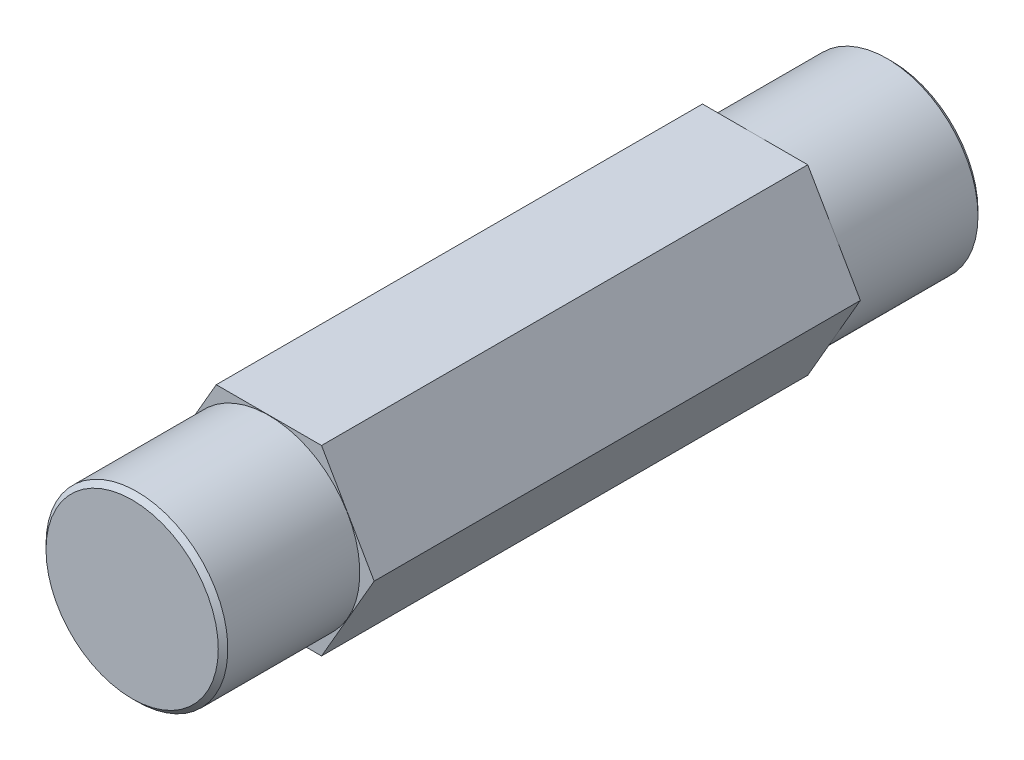
ISO-10303-21;
HEADER;
FILE_DESCRIPTION(('STEP AP214'),'2;1');
FILE_NAME('part.step','',(''),(''),'','','');
FILE_SCHEMA(('AUTOMOTIVE_DESIGN { 1 0 10303 214 1 1 1 1 }'));
ENDSEC;
DATA;
#1=APPLICATION_CONTEXT('core data for automotive mechanical design processes');
#2=APPLICATION_PROTOCOL_DEFINITION('international standard','automotive_design',2000,#1);
#3=PRODUCT_CONTEXT('',#1,'mechanical');
#4=PRODUCT('Part','Part','',(#3));
#5=PRODUCT_RELATED_PRODUCT_CATEGORY('part','',(#4));
#6=PRODUCT_DEFINITION_FORMATION('','',#4);
#7=PRODUCT_DEFINITION_CONTEXT('part definition',#1,'design');
#8=PRODUCT_DEFINITION('design','',#6,#7);
#9=PRODUCT_DEFINITION_SHAPE('','',#8);
#10=(LENGTH_UNIT() NAMED_UNIT(*) SI_UNIT(.MILLI.,.METRE.));
#11=(NAMED_UNIT(*) PLANE_ANGLE_UNIT() SI_UNIT($,.RADIAN.));
#12=(NAMED_UNIT(*) SI_UNIT($,.STERADIAN.) SOLID_ANGLE_UNIT());
#13=UNCERTAINTY_MEASURE_WITH_UNIT(LENGTH_MEASURE(1.E-05),#10,'distance_accuracy_value','');
#14=(GEOMETRIC_REPRESENTATION_CONTEXT(3) GLOBAL_UNCERTAINTY_ASSIGNED_CONTEXT((#13)) GLOBAL_UNIT_ASSIGNED_CONTEXT((#10,
#11,#12)) REPRESENTATION_CONTEXT('',''));
#15=CARTESIAN_POINT('',(0.,0.,0.));
#16=DIRECTION('',(0.,0.,1.));
#17=DIRECTION('',(1.,0.,0.));
#18=AXIS2_PLACEMENT_3D('',#15,#16,#17);
#19=CARTESIAN_POINT('',(0.,0.,19.84375));
#20=DIRECTION('',(0.,0.,1.));
#21=DIRECTION('',(1.,0.,0.));
#22=AXIS2_PLACEMENT_3D('',#19,#20,#21);
#23=PLANE('',#22);
#24=CARTESIAN_POINT('',(0.,0.,19.8437500000637));
#25=DIRECTION('',(0.,0.,-1.));
#26=DIRECTION('',(-1.,0.,0.));
#27=AXIS2_PLACEMENT_3D('',#24,#25,#26);
#28=CIRCLE('',#27,4.49980000001915);
#29=CARTESIAN_POINT('',(-4.49980000001915,0.,19.8437500000637));
#30=VERTEX_POINT('',#29);
#31=EDGE_CURVE('E19',#30,#30,#28,.T.);
#32=ORIENTED_EDGE('',*,*,#31,.F.);
#33=EDGE_LOOP('',(#32));
#34=FACE_BOUND('',#33,.T.);
#35=ADVANCED_FACE('F16',(#34),#23,.T.);
#36=CARTESIAN_POINT('',(0.,0.,-19.84375));
#37=DIRECTION('',(0.,0.,-1.));
#38=DIRECTION('',(-1.,0.,0.));
#39=AXIS2_PLACEMENT_3D('',#36,#37,#38);
#40=PLANE('',#39);
#41=CARTESIAN_POINT('',(0.,0.,-19.8437500000637));
#42=DIRECTION('',(0.,0.,1.));
#43=DIRECTION('',(1.,0.,0.));
#44=AXIS2_PLACEMENT_3D('',#41,#42,#43);
#45=CIRCLE('',#44,4.49980000001915);
#46=CARTESIAN_POINT('',(4.49980000001915,0.,-19.8437500000637));
#47=VERTEX_POINT('',#46);
#48=EDGE_CURVE('E104',#47,#47,#45,.T.);
#49=ORIENTED_EDGE('',*,*,#48,.F.);
#50=EDGE_LOOP('',(#49));
#51=FACE_BOUND('',#50,.T.);
#52=ADVANCED_FACE('F120',(#51),#40,.T.);
#53=CARTESIAN_POINT('',(0.,0.,19.5937500000696));
#54=DIRECTION('',(0.,0.,-1.));
#55=DIRECTION('',(-1.,0.,0.));
#56=AXIS2_PLACEMENT_3D('',#53,#54,#55);
#57=CONICAL_SURFACE('',#56,4.74980000001324,0.785398163397448);
#58=CARTESIAN_POINT('',(0.,0.,19.59375));
#59=DIRECTION('',(0.,0.,-1.));
#60=DIRECTION('',(-1.,0.,0.));
#61=AXIS2_PLACEMENT_3D('',#58,#59,#60);
#62=CIRCLE('',#61,4.7498);
#63=CARTESIAN_POINT('',(-4.7498,0.,19.59375));
#64=VERTEX_POINT('',#63);
#65=EDGE_CURVE('E101',#64,#64,#62,.T.);
#66=ORIENTED_EDGE('',*,*,#65,.F.);
#67=EDGE_LOOP('',(#66));
#68=FACE_BOUND('',#67,.T.);
#69=ORIENTED_EDGE('',*,*,#31,.T.);
#70=EDGE_LOOP('',(#69));
#71=FACE_BOUND('',#70,.T.);
#72=ADVANCED_FACE('F117',(#68,#71),#57,.T.);
#73=CARTESIAN_POINT('',(0.,0.,-19.5937500000696));
#74=DIRECTION('',(0.,0.,1.));
#75=DIRECTION('',(1.,0.,0.));
#76=AXIS2_PLACEMENT_3D('',#73,#74,#75);
#77=CONICAL_SURFACE('',#76,4.74980000001324,0.785398163397448);
#78=CARTESIAN_POINT('',(0.,0.,-19.59375));
#79=DIRECTION('',(0.,0.,1.));
#80=DIRECTION('',(1.,0.,0.));
#81=AXIS2_PLACEMENT_3D('',#78,#79,#80);
#82=CIRCLE('',#81,4.7498);
#83=CARTESIAN_POINT('',(4.7498,0.,-19.59375));
#84=VERTEX_POINT('',#83);
#85=EDGE_CURVE('E86',#84,#84,#82,.T.);
#86=ORIENTED_EDGE('',*,*,#85,.F.);
#87=EDGE_LOOP('',(#86));
#88=FACE_BOUND('',#87,.T.);
#89=ORIENTED_EDGE('',*,*,#48,.T.);
#90=EDGE_LOOP('',(#89));
#91=FACE_BOUND('',#90,.T.);
#92=ADVANCED_FACE('F163',(#88,#91),#77,.T.);
#93=CARTESIAN_POINT('',(0.,0.,19.84375));
#94=DIRECTION('',(0.,0.,-1.));
#95=DIRECTION('',(-1.,0.,0.));
#96=AXIS2_PLACEMENT_3D('',#93,#94,#95);
#97=CYLINDRICAL_SURFACE('',#96,4.7498);
#98=CARTESIAN_POINT('',(0.,0.,12.7));
#99=DIRECTION('',(0.,0.,-1.));
#100=DIRECTION('',(-1.,0.,0.));
#101=AXIS2_PLACEMENT_3D('',#98,#99,#100);
#102=CIRCLE('',#101,4.7498);
#103=CARTESIAN_POINT('',(-4.7498,0.,12.7));
#104=VERTEX_POINT('',#103);
#105=EDGE_CURVE('E109',#104,#104,#102,.T.);
#106=ORIENTED_EDGE('',*,*,#105,.F.);
#107=EDGE_LOOP('',(#106));
#108=FACE_BOUND('',#107,.T.);
#109=ORIENTED_EDGE('',*,*,#65,.T.);
#110=EDGE_LOOP('',(#109));
#111=FACE_BOUND('',#110,.T.);
#112=ADVANCED_FACE('F159',(#108,#111),#97,.T.);
#113=CARTESIAN_POINT('',(0.,0.,-19.84375));
#114=DIRECTION('',(0.,0.,1.));
#115=DIRECTION('',(1.,0.,0.));
#116=AXIS2_PLACEMENT_3D('',#113,#114,#115);
#117=CYLINDRICAL_SURFACE('',#116,4.7498);
#118=CARTESIAN_POINT('',(0.,0.,-12.7));
#119=DIRECTION('',(0.,0.,1.));
#120=DIRECTION('',(1.,0.,0.));
#121=AXIS2_PLACEMENT_3D('',#118,#119,#120);
#122=CIRCLE('',#121,4.7498);
#123=CARTESIAN_POINT('',(4.7498,0.,-12.7));
#124=VERTEX_POINT('',#123);
#125=EDGE_CURVE('E105',#124,#124,#122,.F.);
#126=ORIENTED_EDGE('',*,*,#125,.T.);
#127=EDGE_LOOP('',(#126));
#128=FACE_BOUND('',#127,.T.);
#129=ORIENTED_EDGE('',*,*,#85,.T.);
#130=EDGE_LOOP('',(#129));
#131=FACE_BOUND('',#130,.T.);
#132=ADVANCED_FACE('F156',(#128,#131),#117,.T.);
#133=CARTESIAN_POINT('',(2.74963065701559,4.76250000000001,12.7));
#134=DIRECTION('',(0.,-1.,0.));
#135=DIRECTION('',(1.,0.,0.));
#136=AXIS2_PLACEMENT_3D('',#133,#134,#135);
#137=PLANE('',#136);
#138=DIRECTION('',(0.,0.,1.));
#139=VECTOR('',#138,1.);
#140=CARTESIAN_POINT('',(-2.74963065701557,4.7625,12.7));
#141=LINE('',#140,#139);
#142=CARTESIAN_POINT('',(-2.74963065701557,4.7625,-12.7));
#143=VERTEX_POINT('',#142);
#144=CARTESIAN_POINT('',(-2.74963065701557,4.7625,12.7));
#145=VERTEX_POINT('',#144);
#146=EDGE_CURVE('E79',#143,#145,#141,.T.);
#147=ORIENTED_EDGE('',*,*,#146,.T.);
#148=DIRECTION('',(1.,0.,0.));
#149=VECTOR('',#148,1.);
#150=CARTESIAN_POINT('',(0.,4.76250000000001,12.7));
#151=LINE('',#150,#149);
#152=CARTESIAN_POINT('',(2.74963065701559,4.76250000000001,12.7));
#153=VERTEX_POINT('',#152);
#154=EDGE_CURVE('E69',#153,#145,#151,.F.);
#155=ORIENTED_EDGE('',*,*,#154,.F.);
#156=DIRECTION('',(0.,0.,1.));
#157=VECTOR('',#156,1.);
#158=CARTESIAN_POINT('',(2.74963065701559,4.76250000000001,12.7));
#159=LINE('',#158,#157);
#160=CARTESIAN_POINT('',(2.74963065701559,4.76250000000001,-12.7));
#161=VERTEX_POINT('',#160);
#162=EDGE_CURVE('E108',#153,#161,#159,.F.);
#163=ORIENTED_EDGE('',*,*,#162,.T.);
#164=DIRECTION('',(1.,0.,0.));
#165=VECTOR('',#164,1.);
#166=CARTESIAN_POINT('',(0.,4.76250000000001,-12.7));
#167=LINE('',#166,#165);
#168=EDGE_CURVE('E81',#161,#143,#167,.F.);
#169=ORIENTED_EDGE('',*,*,#168,.T.);
#170=EDGE_LOOP('',(#147,#155,#163,#169));
#171=FACE_BOUND('',#170,.T.);
#172=ADVANCED_FACE('F80',(#171),#137,.F.);
#173=CARTESIAN_POINT('',(-2.74963065701557,4.7625,12.7));
#174=DIRECTION('',(0.866025403784439,-0.5,0.));
#175=DIRECTION('',(0.5,0.866025403784439,0.));
#176=AXIS2_PLACEMENT_3D('',#173,#174,#175);
#177=PLANE('',#176);
#178=DIRECTION('',(0.,0.,1.));
#179=VECTOR('',#178,1.);
#180=CARTESIAN_POINT('',(-5.49926131403116,0.,12.7));
#181=LINE('',#180,#179);
#182=CARTESIAN_POINT('',(-5.49926131403116,0.,-12.7));
#183=VERTEX_POINT('',#182);
#184=CARTESIAN_POINT('',(-5.49926131403116,0.,12.7));
#185=VERTEX_POINT('',#184);
#186=EDGE_CURVE('E85',#183,#185,#181,.T.);
#187=ORIENTED_EDGE('',*,*,#186,.T.);
#188=DIRECTION('',(-0.5,-0.866025403784439,0.));
#189=VECTOR('',#188,1.);
#190=CARTESIAN_POINT('',(-2.74963065701557,4.7625,12.7));
#191=LINE('',#190,#189);
#192=EDGE_CURVE('E66',#145,#185,#191,.T.);
#193=ORIENTED_EDGE('',*,*,#192,.F.);
#194=ORIENTED_EDGE('',*,*,#146,.F.);
#195=DIRECTION('',(-0.5,-0.866025403784439,0.));
#196=VECTOR('',#195,1.);
#197=CARTESIAN_POINT('',(-2.74963065701557,4.7625,-12.7));
#198=LINE('',#197,#196);
#199=EDGE_CURVE('E283',#143,#183,#198,.T.);
#200=ORIENTED_EDGE('',*,*,#199,.T.);
#201=EDGE_LOOP('',(#187,#193,#194,#200));
#202=FACE_BOUND('',#201,.T.);
#203=ADVANCED_FACE('F88',(#202),#177,.F.);
#204=CARTESIAN_POINT('',(-5.49926131403116,0.,12.7));
#205=DIRECTION('',(0.866025403784438,0.500000000000001,0.));
#206=DIRECTION('',(-0.500000000000001,0.866025403784438,0.));
#207=AXIS2_PLACEMENT_3D('',#204,#205,#206);
#208=PLANE('',#207);
#209=DIRECTION('',(0.,0.,1.));
#210=VECTOR('',#209,1.);
#211=CARTESIAN_POINT('',(-2.74963065701554,-4.76250000000002,12.7));
#212=LINE('',#211,#210);
#213=CARTESIAN_POINT('',(-2.74963065701554,-4.76250000000002,-12.7));
#214=VERTEX_POINT('',#213);
#215=CARTESIAN_POINT('',(-2.74963065701554,-4.76250000000002,12.7));
#216=VERTEX_POINT('',#215);
#217=EDGE_CURVE('E76',#214,#216,#212,.T.);
#218=ORIENTED_EDGE('',*,*,#217,.T.);
#219=DIRECTION('',(0.500000000000001,-0.866025403784438,0.));
#220=VECTOR('',#219,1.);
#221=CARTESIAN_POINT('',(-5.49926131403116,0.,12.7));
#222=LINE('',#221,#220);
#223=EDGE_CURVE('E90',#185,#216,#222,.T.);
#224=ORIENTED_EDGE('',*,*,#223,.F.);
#225=ORIENTED_EDGE('',*,*,#186,.F.);
#226=DIRECTION('',(0.500000000000001,-0.866025403784438,0.));
#227=VECTOR('',#226,1.);
#228=CARTESIAN_POINT('',(-5.49926131403116,0.,-12.7));
#229=LINE('',#228,#227);
#230=EDGE_CURVE('E272',#183,#214,#229,.T.);
#231=ORIENTED_EDGE('',*,*,#230,.T.);
#232=EDGE_LOOP('',(#218,#224,#225,#231));
#233=FACE_BOUND('',#232,.T.);
#234=ADVANCED_FACE('F147',(#233),#208,.F.);
#235=CARTESIAN_POINT('',(-2.74963065701554,-4.76250000000002,12.7));
#236=DIRECTION('',(0.,1.,0.));
#237=DIRECTION('',(0.,0.,1.));
#238=AXIS2_PLACEMENT_3D('',#235,#236,#237);
#239=PLANE('',#238);
#240=DIRECTION('',(0.,0.,1.));
#241=VECTOR('',#240,1.);
#242=CARTESIAN_POINT('',(2.74963065701557,-4.76250000000002,12.7));
#243=LINE('',#242,#241);
#244=CARTESIAN_POINT('',(2.74963065701557,-4.76250000000002,-12.7));
#245=VERTEX_POINT('',#244);
#246=CARTESIAN_POINT('',(2.74963065701557,-4.76250000000002,12.7));
#247=VERTEX_POINT('',#246);
#248=EDGE_CURVE('E276',#245,#247,#243,.T.);
#249=ORIENTED_EDGE('',*,*,#248,.T.);
#250=DIRECTION('',(1.,0.,0.));
#251=VECTOR('',#250,1.);
#252=CARTESIAN_POINT('',(0.,-4.76250000000002,12.7));
#253=LINE('',#252,#251);
#254=EDGE_CURVE('E92',#216,#247,#253,.T.);
#255=ORIENTED_EDGE('',*,*,#254,.F.);
#256=ORIENTED_EDGE('',*,*,#217,.F.);
#257=DIRECTION('',(1.,0.,0.));
#258=VECTOR('',#257,1.);
#259=CARTESIAN_POINT('',(0.,-4.76250000000002,-12.7));
#260=LINE('',#259,#258);
#261=EDGE_CURVE('E286',#214,#245,#260,.T.);
#262=ORIENTED_EDGE('',*,*,#261,.T.);
#263=EDGE_LOOP('',(#249,#255,#256,#262));
#264=FACE_BOUND('',#263,.T.);
#265=ADVANCED_FACE('F143',(#264),#239,.F.);
#266=CARTESIAN_POINT('',(0.,0.,12.7));
#267=DIRECTION('',(0.,0.,1.));
#268=DIRECTION('',(1.,0.,0.));
#269=AXIS2_PLACEMENT_3D('',#266,#267,#268);
#270=PLANE('',#269);
#271=ORIENTED_EDGE('',*,*,#105,.T.);
#272=EDGE_LOOP('',(#271));
#273=FACE_BOUND('',#272,.T.);
#274=ORIENTED_EDGE('',*,*,#223,.T.);
#275=ORIENTED_EDGE('',*,*,#254,.T.);
#276=DIRECTION('',(-0.5,-0.866025403784439,0.));
#277=VECTOR('',#276,1.);
#278=CARTESIAN_POINT('',(2.74963065701557,-4.76250000000002,12.7));
#279=LINE('',#278,#277);
#280=CARTESIAN_POINT('',(5.49926131403118,0.,12.7));
#281=VERTEX_POINT('',#280);
#282=EDGE_CURVE('E289',#247,#281,#279,.F.);
#283=ORIENTED_EDGE('',*,*,#282,.T.);
#284=DIRECTION('',(0.500000000000001,-0.866025403784438,0.));
#285=VECTOR('',#284,1.);
#286=CARTESIAN_POINT('',(5.49926131403118,0.,12.7));
#287=LINE('',#286,#285);
#288=EDGE_CURVE('E73',#281,#153,#287,.F.);
#289=ORIENTED_EDGE('',*,*,#288,.T.);
#290=ORIENTED_EDGE('',*,*,#154,.T.);
#291=ORIENTED_EDGE('',*,*,#192,.T.);
#292=EDGE_LOOP('',(#274,#275,#283,#289,#290,#291));
#293=FACE_BOUND('',#292,.T.);
#294=ADVANCED_FACE('F71',(#273,#293),#270,.T.);
#295=CARTESIAN_POINT('',(5.49926131403118,0.,12.7));
#296=DIRECTION('',(-0.866025403784438,-0.500000000000001,0.));
#297=DIRECTION('',(0.500000000000001,-0.866025403784438,0.));
#298=AXIS2_PLACEMENT_3D('',#295,#296,#297);
#299=PLANE('',#298);
#300=ORIENTED_EDGE('',*,*,#162,.F.);
#301=ORIENTED_EDGE('',*,*,#288,.F.);
#302=DIRECTION('',(0.,0.,1.));
#303=VECTOR('',#302,1.);
#304=CARTESIAN_POINT('',(5.49926131403118,0.,12.7));
#305=LINE('',#304,#303);
#306=CARTESIAN_POINT('',(5.49926131403118,0.,-12.7));
#307=VERTEX_POINT('',#306);
#308=EDGE_CURVE('E25',#281,#307,#305,.F.);
#309=ORIENTED_EDGE('',*,*,#308,.T.);
#310=DIRECTION('',(-0.5,0.866025403784438,0.));
#311=VECTOR('',#310,1.);
#312=CARTESIAN_POINT('',(5.49926131403118,0.,-12.7));
#313=LINE('',#312,#311);
#314=EDGE_CURVE('E33',#307,#161,#313,.T.);
#315=ORIENTED_EDGE('',*,*,#314,.T.);
#316=EDGE_LOOP('',(#300,#301,#309,#315));
#317=FACE_BOUND('',#316,.T.);
#318=ADVANCED_FACE('F134',(#317),#299,.F.);
#319=CARTESIAN_POINT('',(0.,0.,-12.7));
#320=DIRECTION('',(0.,0.,1.));
#321=DIRECTION('',(1.,0.,0.));
#322=AXIS2_PLACEMENT_3D('',#319,#320,#321);
#323=PLANE('',#322);
#324=ORIENTED_EDGE('',*,*,#261,.F.);
#325=ORIENTED_EDGE('',*,*,#230,.F.);
#326=ORIENTED_EDGE('',*,*,#199,.F.);
#327=ORIENTED_EDGE('',*,*,#168,.F.);
#328=ORIENTED_EDGE('',*,*,#314,.F.);
#329=DIRECTION('',(-0.5,-0.866025403784439,0.));
#330=VECTOR('',#329,1.);
#331=CARTESIAN_POINT('',(2.74963065701557,-4.76250000000002,-12.7));
#332=LINE('',#331,#330);
#333=EDGE_CURVE('E11',#307,#245,#332,.T.);
#334=ORIENTED_EDGE('',*,*,#333,.T.);
#335=EDGE_LOOP('',(#324,#325,#326,#327,#328,#334));
#336=FACE_BOUND('',#335,.T.);
#337=ORIENTED_EDGE('',*,*,#125,.F.);
#338=EDGE_LOOP('',(#337));
#339=FACE_BOUND('',#338,.T.);
#340=ADVANCED_FACE('F128',(#336,#339),#323,.F.);
#341=CARTESIAN_POINT('',(2.74963065701557,-4.76250000000002,12.7));
#342=DIRECTION('',(-0.866025403784439,0.5,0.));
#343=DIRECTION('',(-0.5,-0.866025403784439,0.));
#344=AXIS2_PLACEMENT_3D('',#341,#342,#343);
#345=PLANE('',#344);
#346=ORIENTED_EDGE('',*,*,#308,.F.);
#347=ORIENTED_EDGE('',*,*,#282,.F.);
#348=ORIENTED_EDGE('',*,*,#248,.F.);
#349=ORIENTED_EDGE('',*,*,#333,.F.);
#350=EDGE_LOOP('',(#346,#347,#348,#349));
#351=FACE_BOUND('',#350,.T.);
#352=ADVANCED_FACE('F126',(#351),#345,.F.);
#353=CLOSED_SHELL('',(#35,#52,#72,#92,#112,#132,#172,#203,#234,#265,#294,#318,#340,#352));
#354=MANIFOLD_SOLID_BREP('B1',#353);
#355=ADVANCED_BREP_SHAPE_REPRESENTATION('',(#18,#354),#14);
#356=SHAPE_DEFINITION_REPRESENTATION(#9,#355);
ENDSEC;
END-ISO-10303-21;
